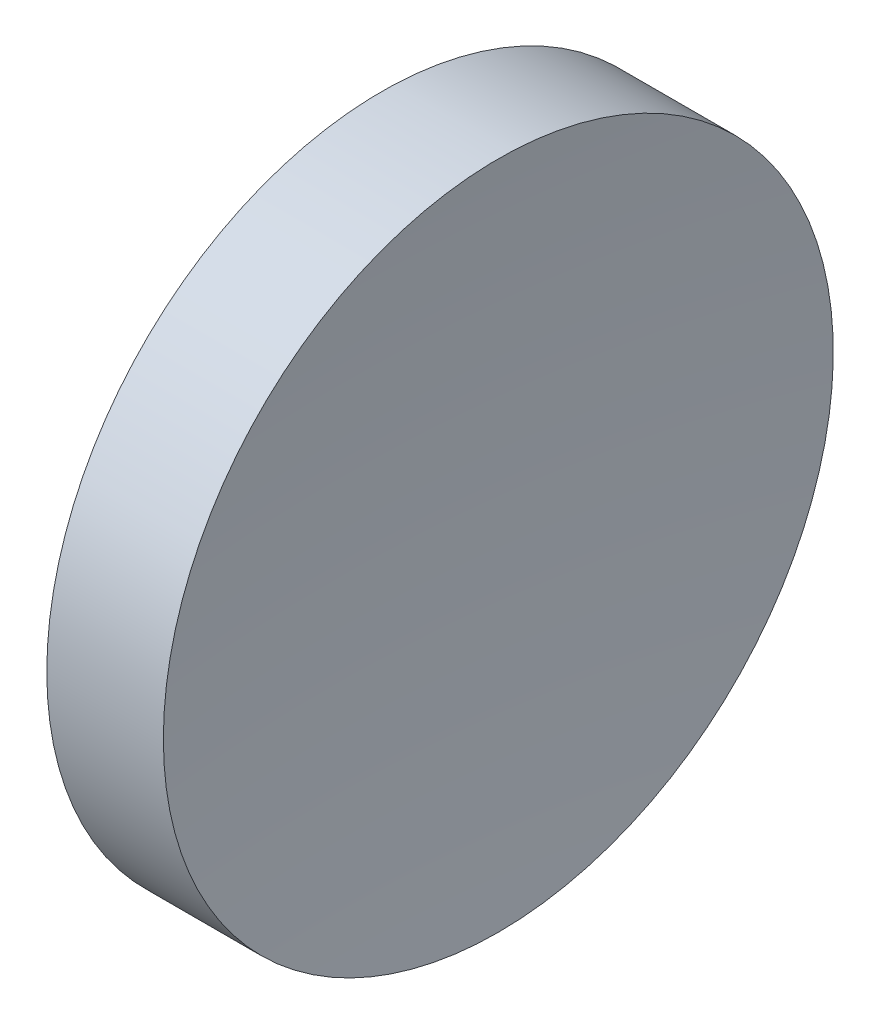
ISO-10303-21;
HEADER;
FILE_DESCRIPTION(('STEP AP214'),'2;1');
FILE_NAME('part.step','',(''),(''),'','','');
FILE_SCHEMA(('AUTOMOTIVE_DESIGN { 1 0 10303 214 1 1 1 1 }'));
ENDSEC;
DATA;
#1=APPLICATION_CONTEXT('core data for automotive mechanical design processes');
#2=APPLICATION_PROTOCOL_DEFINITION('international standard','automotive_design',2000,#1);
#3=PRODUCT_CONTEXT('',#1,'mechanical');
#4=PRODUCT('Part','Part','',(#3));
#5=PRODUCT_RELATED_PRODUCT_CATEGORY('part','',(#4));
#6=PRODUCT_DEFINITION_FORMATION('','',#4);
#7=PRODUCT_DEFINITION_CONTEXT('part definition',#1,'design');
#8=PRODUCT_DEFINITION('design','',#6,#7);
#9=PRODUCT_DEFINITION_SHAPE('','',#8);
#10=(LENGTH_UNIT() NAMED_UNIT(*) SI_UNIT(.MILLI.,.METRE.));
#11=(NAMED_UNIT(*) PLANE_ANGLE_UNIT() SI_UNIT($,.RADIAN.));
#12=(NAMED_UNIT(*) SI_UNIT($,.STERADIAN.) SOLID_ANGLE_UNIT());
#13=UNCERTAINTY_MEASURE_WITH_UNIT(LENGTH_MEASURE(1.E-05),#10,'distance_accuracy_value','');
#14=(GEOMETRIC_REPRESENTATION_CONTEXT(3) GLOBAL_UNCERTAINTY_ASSIGNED_CONTEXT((#13)) GLOBAL_UNIT_ASSIGNED_CONTEXT((#10,
#11,#12)) REPRESENTATION_CONTEXT('',''));
#15=CARTESIAN_POINT('',(0.,0.,0.));
#16=DIRECTION('',(0.,0.,1.));
#17=DIRECTION('',(1.,0.,0.));
#18=AXIS2_PLACEMENT_3D('',#15,#16,#17);
#19=CARTESIAN_POINT('',(98.0229436222455,26.089041149195,0.));
#20=DIRECTION('',(-1.,0.,0.));
#21=DIRECTION('',(0.,-1.,0.));
#22=AXIS2_PLACEMENT_3D('',#19,#20,#21);
#23=SPHERICAL_SURFACE('',#22,52.2033580103609);
#24=CARTESIAN_POINT('',(46.0595854979103,26.089041149195,0.));
#25=DIRECTION('',(-1.,0.,0.));
#26=DIRECTION('',(0.,0.,1.));
#27=AXIS2_PLACEMENT_3D('',#24,#25,#26);
#28=CIRCLE('',#27,5.);
#29=CARTESIAN_POINT('',(46.0595854979103,26.089041149195,5.));
#30=VERTEX_POINT('',#29);
#31=EDGE_CURVE('E10',#30,#30,#28,.T.);
#32=ORIENTED_EDGE('',*,*,#31,.F.);
#33=EDGE_LOOP('',(#32));
#34=FACE_BOUND('',#33,.T.);
#35=ADVANCED_FACE('F35',(#34),#23,.F.);
#36=CARTESIAN_POINT('',(42.4498611141368,26.089041149195,0.));
#37=DIRECTION('',(-1.,0.,0.));
#38=DIRECTION('',(0.,0.,1.));
#39=AXIS2_PLACEMENT_3D('',#36,#37,#38);
#40=CYLINDRICAL_SURFACE('',#39,5.);
#41=CARTESIAN_POINT('',(44.3195854979103,26.089041149195,0.));
#42=DIRECTION('',(-1.,0.,0.));
#43=DIRECTION('',(0.,0.,1.));
#44=AXIS2_PLACEMENT_3D('',#41,#42,#43);
#45=CIRCLE('',#44,5.);
#46=CARTESIAN_POINT('',(44.3195854979103,26.089041149195,5.));
#47=VERTEX_POINT('',#46);
#48=EDGE_CURVE('E41',#47,#47,#45,.T.);
#49=ORIENTED_EDGE('',*,*,#48,.F.);
#50=EDGE_LOOP('',(#49));
#51=FACE_BOUND('',#50,.T.);
#52=ORIENTED_EDGE('',*,*,#31,.T.);
#53=EDGE_LOOP('',(#52));
#54=FACE_BOUND('',#53,.T.);
#55=ADVANCED_FACE('F49',(#51,#54),#40,.T.);
#56=CARTESIAN_POINT('',(44.3195854979103,26.089041149195,0.));
#57=DIRECTION('',(1.,0.,0.));
#58=DIRECTION('',(0.,0.,-1.));
#59=AXIS2_PLACEMENT_3D('',#56,#57,#58);
#60=PLANE('',#59);
#61=ORIENTED_EDGE('',*,*,#48,.T.);
#62=EDGE_LOOP('',(#61));
#63=FACE_BOUND('',#62,.T.);
#64=ADVANCED_FACE('F47',(#63),#60,.F.);
#65=CLOSED_SHELL('',(#35,#55,#64));
#66=MANIFOLD_SOLID_BREP('B2',#65);
#67=ADVANCED_BREP_SHAPE_REPRESENTATION('',(#18,#66),#14);
#68=SHAPE_DEFINITION_REPRESENTATION(#9,#67);
ENDSEC;
END-ISO-10303-21;
